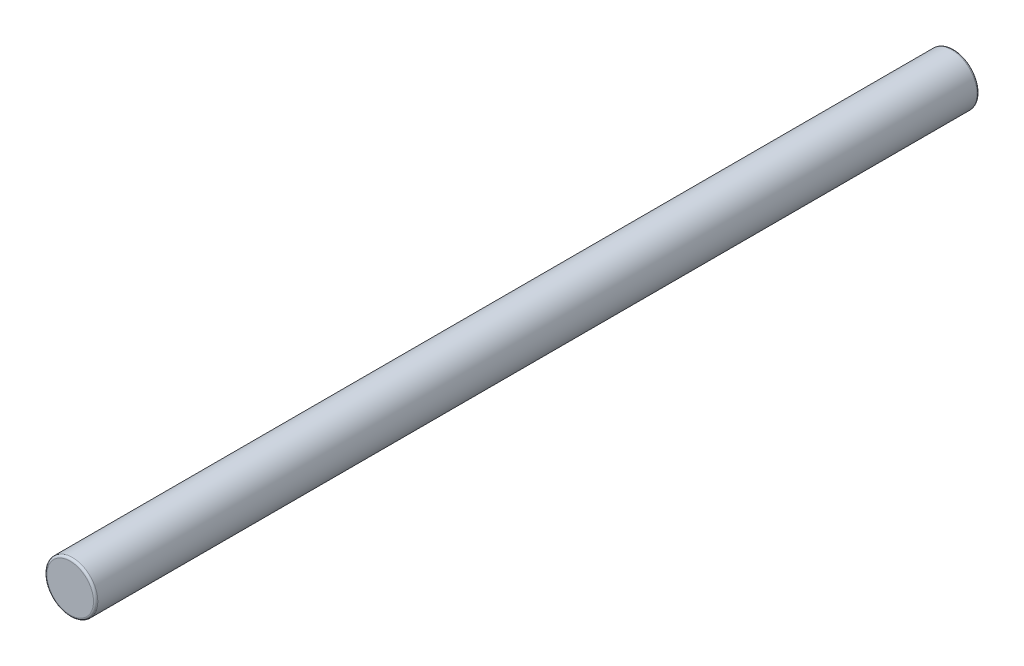
ISO-10303-21;
HEADER;
FILE_DESCRIPTION(('STEP AP214'),'2;1');
FILE_NAME('part.step','',(''),(''),'','','');
FILE_SCHEMA(('AUTOMOTIVE_DESIGN { 1 0 10303 214 1 1 1 1 }'));
ENDSEC;
DATA;
#1=APPLICATION_CONTEXT('core data for automotive mechanical design processes');
#2=APPLICATION_PROTOCOL_DEFINITION('international standard','automotive_design',2000,#1);
#3=PRODUCT_CONTEXT('',#1,'mechanical');
#4=PRODUCT('Part','Part','',(#3));
#5=PRODUCT_RELATED_PRODUCT_CATEGORY('part','',(#4));
#6=PRODUCT_DEFINITION_FORMATION('','',#4);
#7=PRODUCT_DEFINITION_CONTEXT('part definition',#1,'design');
#8=PRODUCT_DEFINITION('design','',#6,#7);
#9=PRODUCT_DEFINITION_SHAPE('','',#8);
#10=(LENGTH_UNIT() NAMED_UNIT(*) SI_UNIT(.MILLI.,.METRE.));
#11=(NAMED_UNIT(*) PLANE_ANGLE_UNIT() SI_UNIT($,.RADIAN.));
#12=(NAMED_UNIT(*) SI_UNIT($,.STERADIAN.) SOLID_ANGLE_UNIT());
#13=UNCERTAINTY_MEASURE_WITH_UNIT(LENGTH_MEASURE(1.E-05),#10,'distance_accuracy_value','');
#14=(GEOMETRIC_REPRESENTATION_CONTEXT(3) GLOBAL_UNCERTAINTY_ASSIGNED_CONTEXT((#13)) GLOBAL_UNIT_ASSIGNED_CONTEXT((#10,
#11,#12)) REPRESENTATION_CONTEXT('',''));
#15=CARTESIAN_POINT('',(0.,0.,0.));
#16=DIRECTION('',(0.,0.,1.));
#17=DIRECTION('',(1.,0.,0.));
#18=AXIS2_PLACEMENT_3D('',#15,#16,#17);
#19=CARTESIAN_POINT('',(0.,0.,26.));
#20=DIRECTION('',(0.,0.,-1.));
#21=DIRECTION('',(-1.,0.,0.));
#22=AXIS2_PLACEMENT_3D('',#19,#20,#21);
#23=CYLINDRICAL_SURFACE('',#22,1.5);
#24=CARTESIAN_POINT('',(0.,0.,-25.873));
#25=DIRECTION('',(0.,0.,1.));
#26=DIRECTION('',(1.,0.,0.));
#27=AXIS2_PLACEMENT_3D('',#24,#25,#26);
#28=CIRCLE('',#27,1.5);
#29=CARTESIAN_POINT('',(1.5,0.,-25.873));
#30=VERTEX_POINT('',#29);
#31=EDGE_CURVE('E43',#30,#30,#28,.T.);
#32=ORIENTED_EDGE('',*,*,#31,.T.);
#33=EDGE_LOOP('',(#32));
#34=FACE_BOUND('',#33,.T.);
#35=CARTESIAN_POINT('',(0.,0.,25.873));
#36=DIRECTION('',(0.,0.,1.));
#37=DIRECTION('',(1.,0.,0.));
#38=AXIS2_PLACEMENT_3D('',#35,#36,#37);
#39=CIRCLE('',#38,1.5);
#40=CARTESIAN_POINT('',(1.5,0.,25.873));
#41=VERTEX_POINT('',#40);
#42=EDGE_CURVE('E47',#41,#41,#39,.F.);
#43=ORIENTED_EDGE('',*,*,#42,.T.);
#44=EDGE_LOOP('',(#43));
#45=FACE_BOUND('',#44,.T.);
#46=ADVANCED_FACE('F32',(#34,#45),#23,.T.);
#47=CARTESIAN_POINT('',(0.,0.,26.));
#48=DIRECTION('',(0.,0.,1.));
#49=DIRECTION('',(1.,0.,0.));
#50=AXIS2_PLACEMENT_3D('',#47,#48,#49);
#51=PLANE('',#50);
#52=CARTESIAN_POINT('',(0.,0.,26.));
#53=DIRECTION('',(0.,0.,1.));
#54=DIRECTION('',(1.,0.,0.));
#55=AXIS2_PLACEMENT_3D('',#52,#53,#54);
#56=CIRCLE('',#55,1.373);
#57=CARTESIAN_POINT('',(1.373,0.,26.));
#58=VERTEX_POINT('',#57);
#59=EDGE_CURVE('E10',#58,#58,#56,.T.);
#60=ORIENTED_EDGE('',*,*,#59,.T.);
#61=EDGE_LOOP('',(#60));
#62=FACE_BOUND('',#61,.T.);
#63=ADVANCED_FACE('F63',(#62),#51,.T.);
#64=CARTESIAN_POINT('',(0.,0.,-26.));
#65=DIRECTION('',(0.,0.,1.));
#66=DIRECTION('',(1.,0.,0.));
#67=AXIS2_PLACEMENT_3D('',#64,#65,#66);
#68=PLANE('',#67);
#69=CARTESIAN_POINT('',(0.,0.,-26.));
#70=DIRECTION('',(0.,0.,1.));
#71=DIRECTION('',(1.,0.,0.));
#72=AXIS2_PLACEMENT_3D('',#69,#70,#71);
#73=CIRCLE('',#72,1.373);
#74=CARTESIAN_POINT('',(1.373,0.,-26.));
#75=VERTEX_POINT('',#74);
#76=EDGE_CURVE('E39',#75,#75,#73,.F.);
#77=ORIENTED_EDGE('',*,*,#76,.T.);
#78=EDGE_LOOP('',(#77));
#79=FACE_BOUND('',#78,.T.);
#80=ADVANCED_FACE('F60',(#79),#68,.F.);
#81=CARTESIAN_POINT('',(0.,0.,-25.873));
#82=DIRECTION('',(0.,0.,1.));
#83=DIRECTION('',(1.,0.,0.));
#84=AXIS2_PLACEMENT_3D('',#81,#82,#83);
#85=TOROIDAL_SURFACE('',#84,1.373,0.127);
#86=ORIENTED_EDGE('',*,*,#76,.F.);
#87=EDGE_LOOP('',(#86));
#88=FACE_BOUND('',#87,.T.);
#89=ORIENTED_EDGE('',*,*,#31,.F.);
#90=EDGE_LOOP('',(#89));
#91=FACE_BOUND('',#90,.T.);
#92=ADVANCED_FACE('F56',(#88,#91),#85,.T.);
#93=CARTESIAN_POINT('',(0.,0.,25.873));
#94=DIRECTION('',(0.,0.,1.));
#95=DIRECTION('',(1.,0.,0.));
#96=AXIS2_PLACEMENT_3D('',#93,#94,#95);
#97=TOROIDAL_SURFACE('',#96,1.373,0.127);
#98=ORIENTED_EDGE('',*,*,#42,.F.);
#99=EDGE_LOOP('',(#98));
#100=FACE_BOUND('',#99,.T.);
#101=ORIENTED_EDGE('',*,*,#59,.F.);
#102=EDGE_LOOP('',(#101));
#103=FACE_BOUND('',#102,.T.);
#104=ADVANCED_FACE('F34',(#100,#103),#97,.T.);
#105=CLOSED_SHELL('',(#46,#63,#80,#92,#104));
#106=MANIFOLD_SOLID_BREP('B2',#105);
#107=ADVANCED_BREP_SHAPE_REPRESENTATION('',(#18,#106),#14);
#108=SHAPE_DEFINITION_REPRESENTATION(#9,#107);
ENDSEC;
END-ISO-10303-21;
